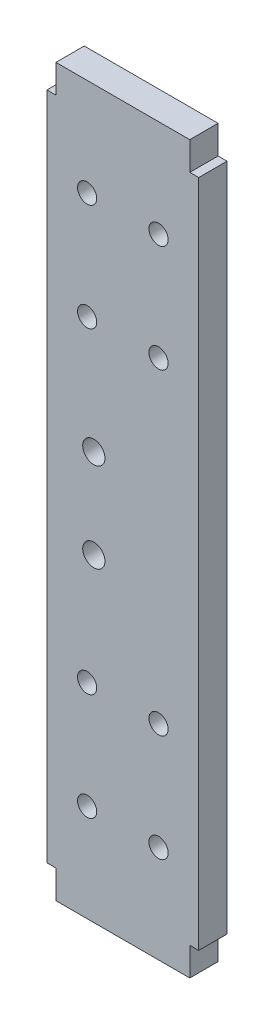
ISO-10303-21;
HEADER;
FILE_DESCRIPTION(('STEP AP214'),'2;1');
FILE_NAME('part.step','',(''),(''),'','','');
FILE_SCHEMA(('AUTOMOTIVE_DESIGN { 1 0 10303 214 1 1 1 1 }'));
ENDSEC;
DATA;
#1=APPLICATION_CONTEXT('core data for automotive mechanical design processes');
#2=APPLICATION_PROTOCOL_DEFINITION('international standard','automotive_design',2000,#1);
#3=PRODUCT_CONTEXT('',#1,'mechanical');
#4=PRODUCT('Part','Part','',(#3));
#5=PRODUCT_RELATED_PRODUCT_CATEGORY('part','',(#4));
#6=PRODUCT_DEFINITION_FORMATION('','',#4);
#7=PRODUCT_DEFINITION_CONTEXT('part definition',#1,'design');
#8=PRODUCT_DEFINITION('design','',#6,#7);
#9=PRODUCT_DEFINITION_SHAPE('','',#8);
#10=(LENGTH_UNIT() NAMED_UNIT(*) SI_UNIT(.MILLI.,.METRE.));
#11=(NAMED_UNIT(*) PLANE_ANGLE_UNIT() SI_UNIT($,.RADIAN.));
#12=(NAMED_UNIT(*) SI_UNIT($,.STERADIAN.) SOLID_ANGLE_UNIT());
#13=UNCERTAINTY_MEASURE_WITH_UNIT(LENGTH_MEASURE(1.E-05),#10,'distance_accuracy_value','');
#14=(GEOMETRIC_REPRESENTATION_CONTEXT(3) GLOBAL_UNCERTAINTY_ASSIGNED_CONTEXT((#13)) GLOBAL_UNIT_ASSIGNED_CONTEXT((#10,
#11,#12)) REPRESENTATION_CONTEXT('',''));
#15=CARTESIAN_POINT('',(0.,0.,0.));
#16=DIRECTION('',(0.,0.,1.));
#17=DIRECTION('',(1.,0.,0.));
#18=AXIS2_PLACEMENT_3D('',#15,#16,#17);
#19=CARTESIAN_POINT('',(-17.,-75.,6.35));
#20=DIRECTION('',(0.,1.,0.));
#21=DIRECTION('',(0.,0.,1.));
#22=AXIS2_PLACEMENT_3D('',#19,#20,#21);
#23=PLANE('',#22);
#24=DIRECTION('',(0.,0.,1.));
#25=VECTOR('',#24,1.);
#26=CARTESIAN_POINT('',(15.,-75.,0.));
#27=LINE('',#26,#25);
#28=CARTESIAN_POINT('',(15.,-75.,0.));
#29=VERTEX_POINT('',#28);
#30=CARTESIAN_POINT('',(15.,-75.,6.35));
#31=VERTEX_POINT('',#30);
#32=EDGE_CURVE('E133',#29,#31,#27,.T.);
#33=ORIENTED_EDGE('',*,*,#32,.F.);
#34=DIRECTION('',(1.,0.,0.));
#35=VECTOR('',#34,1.);
#36=CARTESIAN_POINT('',(-17.,-75.,0.));
#37=LINE('',#36,#35);
#38=CARTESIAN_POINT('',(17.,-75.,0.));
#39=VERTEX_POINT('',#38);
#40=EDGE_CURVE('E145',#29,#39,#37,.T.);
#41=ORIENTED_EDGE('',*,*,#40,.T.);
#42=DIRECTION('',(0.,0.,-1.));
#43=VECTOR('',#42,1.);
#44=CARTESIAN_POINT('',(17.,-75.,6.35));
#45=LINE('',#44,#43);
#46=CARTESIAN_POINT('',(17.,-75.,6.35));
#47=VERTEX_POINT('',#46);
#48=EDGE_CURVE('E11',#47,#39,#45,.T.);
#49=ORIENTED_EDGE('',*,*,#48,.F.);
#50=DIRECTION('',(1.,0.,0.));
#51=VECTOR('',#50,1.);
#52=CARTESIAN_POINT('',(-17.,-75.,6.35));
#53=LINE('',#52,#51);
#54=EDGE_CURVE('E323',#31,#47,#53,.T.);
#55=ORIENTED_EDGE('',*,*,#54,.F.);
#56=EDGE_LOOP('',(#33,#41,#49,#55));
#57=FACE_BOUND('',#56,.T.);
#58=ADVANCED_FACE('F32',(#57),#23,.F.);
#59=CARTESIAN_POINT('',(-17.,75.,6.35));
#60=DIRECTION('',(0.,-1.,0.));
#61=DIRECTION('',(0.,0.,-1.));
#62=AXIS2_PLACEMENT_3D('',#59,#60,#61);
#63=PLANE('',#62);
#64=DIRECTION('',(0.,0.,1.));
#65=VECTOR('',#64,1.);
#66=CARTESIAN_POINT('',(-15.,75.,0.));
#67=LINE('',#66,#65);
#68=CARTESIAN_POINT('',(-15.,75.,0.));
#69=VERTEX_POINT('',#68);
#70=CARTESIAN_POINT('',(-15.,75.,6.35));
#71=VERTEX_POINT('',#70);
#72=EDGE_CURVE('E336',#69,#71,#67,.T.);
#73=ORIENTED_EDGE('',*,*,#72,.F.);
#74=DIRECTION('',(-1.,0.,0.));
#75=VECTOR('',#74,1.);
#76=CARTESIAN_POINT('',(-17.,75.,0.));
#77=LINE('',#76,#75);
#78=CARTESIAN_POINT('',(-17.,75.,0.));
#79=VERTEX_POINT('',#78);
#80=EDGE_CURVE('E273',#69,#79,#77,.T.);
#81=ORIENTED_EDGE('',*,*,#80,.T.);
#82=DIRECTION('',(0.,0.,-1.));
#83=VECTOR('',#82,1.);
#84=CARTESIAN_POINT('',(-17.,75.,6.35));
#85=LINE('',#84,#83);
#86=CARTESIAN_POINT('',(-17.,75.,6.35));
#87=VERTEX_POINT('',#86);
#88=EDGE_CURVE('E301',#87,#79,#85,.T.);
#89=ORIENTED_EDGE('',*,*,#88,.F.);
#90=DIRECTION('',(-1.,0.,0.));
#91=VECTOR('',#90,1.);
#92=CARTESIAN_POINT('',(-17.,75.,6.35));
#93=LINE('',#92,#91);
#94=EDGE_CURVE('E307',#71,#87,#93,.T.);
#95=ORIENTED_EDGE('',*,*,#94,.F.);
#96=EDGE_LOOP('',(#73,#81,#89,#95));
#97=FACE_BOUND('',#96,.T.);
#98=ADVANCED_FACE('F248',(#97),#63,.F.);
#99=CARTESIAN_POINT('',(-17.,-75.,0.));
#100=VERTEX_POINT('',#99);
#101=CARTESIAN_POINT('',(-15.,-75.,0.));
#102=VERTEX_POINT('',#101);
#103=EDGE_CURVE('E265',#100,#102,#37,.T.);
#104=ORIENTED_EDGE('',*,*,#103,.T.);
#105=DIRECTION('',(0.,0.,1.));
#106=VECTOR('',#105,1.);
#107=CARTESIAN_POINT('',(-15.,-75.,0.));
#108=LINE('',#107,#106);
#109=CARTESIAN_POINT('',(-15.,-75.,6.35));
#110=VERTEX_POINT('',#109);
#111=EDGE_CURVE('E159',#102,#110,#108,.T.);
#112=ORIENTED_EDGE('',*,*,#111,.T.);
#113=CARTESIAN_POINT('',(-17.,-75.,6.35));
#114=VERTEX_POINT('',#113);
#115=EDGE_CURVE('E316',#114,#110,#53,.T.);
#116=ORIENTED_EDGE('',*,*,#115,.F.);
#117=DIRECTION('',(0.,0.,-1.));
#118=VECTOR('',#117,1.);
#119=CARTESIAN_POINT('',(-17.,-75.,6.35));
#120=LINE('',#119,#118);
#121=EDGE_CURVE('E269',#114,#100,#120,.T.);
#122=ORIENTED_EDGE('',*,*,#121,.T.);
#123=EDGE_LOOP('',(#104,#112,#116,#122));
#124=FACE_BOUND('',#123,.T.);
#125=ADVANCED_FACE('F34',(#124),#23,.F.);
#126=CARTESIAN_POINT('',(17.,-75.,6.35));
#127=DIRECTION('',(-1.,0.,0.));
#128=DIRECTION('',(0.,0.,1.));
#129=AXIS2_PLACEMENT_3D('',#126,#127,#128);
#130=PLANE('',#129);
#131=DIRECTION('',(0.,1.,0.));
#132=VECTOR('',#131,1.);
#133=CARTESIAN_POINT('',(17.,-75.,0.));
#134=LINE('',#133,#132);
#135=CARTESIAN_POINT('',(17.,75.,0.));
#136=VERTEX_POINT('',#135);
#137=EDGE_CURVE('E271',#39,#136,#134,.T.);
#138=ORIENTED_EDGE('',*,*,#137,.T.);
#139=DIRECTION('',(0.,0.,-1.));
#140=VECTOR('',#139,1.);
#141=CARTESIAN_POINT('',(17.,75.,6.35));
#142=LINE('',#141,#140);
#143=CARTESIAN_POINT('',(17.,75.,6.35));
#144=VERTEX_POINT('',#143);
#145=EDGE_CURVE('E41',#144,#136,#142,.T.);
#146=ORIENTED_EDGE('',*,*,#145,.F.);
#147=DIRECTION('',(0.,1.,0.));
#148=VECTOR('',#147,1.);
#149=CARTESIAN_POINT('',(17.,-75.,6.35));
#150=LINE('',#149,#148);
#151=EDGE_CURVE('E309',#47,#144,#150,.T.);
#152=ORIENTED_EDGE('',*,*,#151,.F.);
#153=ORIENTED_EDGE('',*,*,#48,.T.);
#154=EDGE_LOOP('',(#138,#146,#152,#153));
#155=FACE_BOUND('',#154,.T.);
#156=ADVANCED_FACE('F257',(#155),#130,.F.);
#157=CARTESIAN_POINT('',(15.,75.,0.));
#158=VERTEX_POINT('',#157);
#159=EDGE_CURVE('E296',#136,#158,#77,.T.);
#160=ORIENTED_EDGE('',*,*,#159,.T.);
#161=DIRECTION('',(0.,0.,1.));
#162=VECTOR('',#161,1.);
#163=CARTESIAN_POINT('',(15.,75.,0.));
#164=LINE('',#163,#162);
#165=CARTESIAN_POINT('',(15.,75.,6.35));
#166=VERTEX_POINT('',#165);
#167=EDGE_CURVE('E340',#158,#166,#164,.T.);
#168=ORIENTED_EDGE('',*,*,#167,.T.);
#169=EDGE_CURVE('E303',#144,#166,#93,.T.);
#170=ORIENTED_EDGE('',*,*,#169,.F.);
#171=ORIENTED_EDGE('',*,*,#145,.T.);
#172=EDGE_LOOP('',(#160,#168,#170,#171));
#173=FACE_BOUND('',#172,.T.);
#174=ADVANCED_FACE('F255',(#173),#63,.F.);
#175=CARTESIAN_POINT('',(-17.,-75.,6.35));
#176=DIRECTION('',(1.,0.,0.));
#177=DIRECTION('',(0.,0.,-1.));
#178=AXIS2_PLACEMENT_3D('',#175,#176,#177);
#179=PLANE('',#178);
#180=DIRECTION('',(0.,-1.,0.));
#181=VECTOR('',#180,1.);
#182=CARTESIAN_POINT('',(-17.,-75.,0.));
#183=LINE('',#182,#181);
#184=EDGE_CURVE('E290',#79,#100,#183,.T.);
#185=ORIENTED_EDGE('',*,*,#184,.T.);
#186=ORIENTED_EDGE('',*,*,#121,.F.);
#187=DIRECTION('',(0.,-1.,0.));
#188=VECTOR('',#187,1.);
#189=CARTESIAN_POINT('',(-17.,-75.,6.35));
#190=LINE('',#189,#188);
#191=EDGE_CURVE('E284',#87,#114,#190,.T.);
#192=ORIENTED_EDGE('',*,*,#191,.F.);
#193=ORIENTED_EDGE('',*,*,#88,.T.);
#194=EDGE_LOOP('',(#185,#186,#192,#193));
#195=FACE_BOUND('',#194,.T.);
#196=ADVANCED_FACE('F327',(#195),#179,.F.);
#197=CARTESIAN_POINT('',(0.,0.,6.35));
#198=DIRECTION('',(0.,0.,1.));
#199=DIRECTION('',(1.,0.,0.));
#200=AXIS2_PLACEMENT_3D('',#197,#198,#199);
#201=PLANE('',#200);
#202=CARTESIAN_POINT('',(-6.5,10.,6.35));
#203=DIRECTION('',(0.,0.,1.));
#204=DIRECTION('',(1.,0.,0.));
#205=AXIS2_PLACEMENT_3D('',#202,#203,#204);
#206=CIRCLE('',#205,2.48919999999999);
#207=CARTESIAN_POINT('',(-4.01080000000001,10.,6.35));
#208=VERTEX_POINT('',#207);
#209=EDGE_CURVE('E536',#208,#208,#206,.T.);
#210=ORIENTED_EDGE('',*,*,#209,.F.);
#211=EDGE_LOOP('',(#210));
#212=FACE_BOUND('',#211,.T.);
#213=CARTESIAN_POINT('',(-6.5,-10.,6.35));
#214=DIRECTION('',(0.,0.,1.));
#215=DIRECTION('',(1.,0.,0.));
#216=AXIS2_PLACEMENT_3D('',#213,#214,#215);
#217=CIRCLE('',#216,2.48919999999999);
#218=CARTESIAN_POINT('',(-4.01080000000001,-10.,6.35));
#219=VERTEX_POINT('',#218);
#220=EDGE_CURVE('E210',#219,#219,#217,.T.);
#221=ORIENTED_EDGE('',*,*,#220,.F.);
#222=EDGE_LOOP('',(#221));
#223=FACE_BOUND('',#222,.T.);
#224=CARTESIAN_POINT('',(-8.,59.5,6.35));
#225=DIRECTION('',(0.,0.,1.));
#226=DIRECTION('',(1.,0.,0.));
#227=AXIS2_PLACEMENT_3D('',#224,#225,#226);
#228=CIRCLE('',#227,2.15265);
#229=CARTESIAN_POINT('',(-5.84735,59.5,6.35));
#230=VERTEX_POINT('',#229);
#231=EDGE_CURVE('E199',#230,#230,#228,.T.);
#232=ORIENTED_EDGE('',*,*,#231,.F.);
#233=EDGE_LOOP('',(#232));
#234=FACE_BOUND('',#233,.T.);
#235=CARTESIAN_POINT('',(8.,59.5,6.35));
#236=DIRECTION('',(0.,0.,1.));
#237=DIRECTION('',(1.,0.,0.));
#238=AXIS2_PLACEMENT_3D('',#235,#236,#237);
#239=CIRCLE('',#238,2.15265);
#240=CARTESIAN_POINT('',(10.15265,59.5,6.35));
#241=VERTEX_POINT('',#240);
#242=EDGE_CURVE('E196',#241,#241,#239,.T.);
#243=ORIENTED_EDGE('',*,*,#242,.F.);
#244=EDGE_LOOP('',(#243));
#245=FACE_BOUND('',#244,.T.);
#246=CARTESIAN_POINT('',(8.,35.5,6.35));
#247=DIRECTION('',(0.,0.,1.));
#248=DIRECTION('',(1.,0.,0.));
#249=AXIS2_PLACEMENT_3D('',#246,#247,#248);
#250=CIRCLE('',#249,2.15265);
#251=CARTESIAN_POINT('',(10.15265,35.5,6.35));
#252=VERTEX_POINT('',#251);
#253=EDGE_CURVE('E193',#252,#252,#250,.T.);
#254=ORIENTED_EDGE('',*,*,#253,.F.);
#255=EDGE_LOOP('',(#254));
#256=FACE_BOUND('',#255,.T.);
#257=CARTESIAN_POINT('',(-8.,35.5,6.35));
#258=DIRECTION('',(0.,0.,1.));
#259=DIRECTION('',(1.,0.,0.));
#260=AXIS2_PLACEMENT_3D('',#257,#258,#259);
#261=CIRCLE('',#260,2.15265);
#262=CARTESIAN_POINT('',(-5.84735,35.5,6.35));
#263=VERTEX_POINT('',#262);
#264=EDGE_CURVE('E189',#263,#263,#261,.T.);
#265=ORIENTED_EDGE('',*,*,#264,.F.);
#266=EDGE_LOOP('',(#265));
#267=FACE_BOUND('',#266,.T.);
#268=CARTESIAN_POINT('',(-7.99999999999999,-35.5,6.35));
#269=DIRECTION('',(0.,0.,1.));
#270=DIRECTION('',(1.,0.,0.));
#271=AXIS2_PLACEMENT_3D('',#268,#269,#270);
#272=CIRCLE('',#271,2.15265);
#273=CARTESIAN_POINT('',(-5.84734999999999,-35.5,6.35));
#274=VERTEX_POINT('',#273);
#275=EDGE_CURVE('E188',#274,#274,#272,.T.);
#276=ORIENTED_EDGE('',*,*,#275,.F.);
#277=EDGE_LOOP('',(#276));
#278=FACE_BOUND('',#277,.T.);
#279=CARTESIAN_POINT('',(-8.,-59.5,6.35));
#280=DIRECTION('',(0.,0.,1.));
#281=DIRECTION('',(1.,0.,0.));
#282=AXIS2_PLACEMENT_3D('',#279,#280,#281);
#283=CIRCLE('',#282,2.15265);
#284=CARTESIAN_POINT('',(-5.84735,-59.5,6.35));
#285=VERTEX_POINT('',#284);
#286=EDGE_CURVE('E184',#285,#285,#283,.T.);
#287=ORIENTED_EDGE('',*,*,#286,.F.);
#288=EDGE_LOOP('',(#287));
#289=FACE_BOUND('',#288,.T.);
#290=CARTESIAN_POINT('',(8.,-59.5,6.35));
#291=DIRECTION('',(0.,0.,1.));
#292=DIRECTION('',(1.,0.,0.));
#293=AXIS2_PLACEMENT_3D('',#290,#291,#292);
#294=CIRCLE('',#293,2.15265);
#295=CARTESIAN_POINT('',(10.15265,-59.5,6.35));
#296=VERTEX_POINT('',#295);
#297=EDGE_CURVE('E180',#296,#296,#294,.T.);
#298=ORIENTED_EDGE('',*,*,#297,.F.);
#299=EDGE_LOOP('',(#298));
#300=FACE_BOUND('',#299,.T.);
#301=CARTESIAN_POINT('',(8.00000000000001,-35.5,6.35));
#302=DIRECTION('',(0.,0.,1.));
#303=DIRECTION('',(1.,0.,0.));
#304=AXIS2_PLACEMENT_3D('',#301,#302,#303);
#305=CIRCLE('',#304,2.15265);
#306=CARTESIAN_POINT('',(10.15265,-35.5,6.35));
#307=VERTEX_POINT('',#306);
#308=EDGE_CURVE('E179',#307,#307,#305,.T.);
#309=ORIENTED_EDGE('',*,*,#308,.F.);
#310=EDGE_LOOP('',(#309));
#311=FACE_BOUND('',#310,.T.);
#312=ORIENTED_EDGE('',*,*,#115,.T.);
#313=DIRECTION('',(0.,-1.,0.));
#314=VECTOR('',#313,1.);
#315=CARTESIAN_POINT('',(-15.,-81.35,6.35));
#316=LINE('',#315,#314);
#317=CARTESIAN_POINT('',(-15.,-81.35,6.35));
#318=VERTEX_POINT('',#317);
#319=EDGE_CURVE('E49',#110,#318,#316,.T.);
#320=ORIENTED_EDGE('',*,*,#319,.T.);
#321=DIRECTION('',(1.,0.,0.));
#322=VECTOR('',#321,1.);
#323=CARTESIAN_POINT('',(-15.,-81.35,6.35));
#324=LINE('',#323,#322);
#325=CARTESIAN_POINT('',(15.,-81.35,6.35));
#326=VERTEX_POINT('',#325);
#327=EDGE_CURVE('E155',#318,#326,#324,.T.);
#328=ORIENTED_EDGE('',*,*,#327,.T.);
#329=DIRECTION('',(0.,1.,0.));
#330=VECTOR('',#329,1.);
#331=CARTESIAN_POINT('',(15.,-81.35,6.35));
#332=LINE('',#331,#330);
#333=EDGE_CURVE('E128',#326,#31,#332,.T.);
#334=ORIENTED_EDGE('',*,*,#333,.T.);
#335=ORIENTED_EDGE('',*,*,#54,.T.);
#336=ORIENTED_EDGE('',*,*,#151,.T.);
#337=ORIENTED_EDGE('',*,*,#169,.T.);
#338=DIRECTION('',(0.,1.,0.));
#339=VECTOR('',#338,1.);
#340=CARTESIAN_POINT('',(15.,81.35,6.35));
#341=LINE('',#340,#339);
#342=CARTESIAN_POINT('',(15.,81.35,6.35));
#343=VERTEX_POINT('',#342);
#344=EDGE_CURVE('E57',#166,#343,#341,.T.);
#345=ORIENTED_EDGE('',*,*,#344,.T.);
#346=DIRECTION('',(-1.,0.,0.));
#347=VECTOR('',#346,1.);
#348=CARTESIAN_POINT('',(-15.,81.35,6.35));
#349=LINE('',#348,#347);
#350=CARTESIAN_POINT('',(-15.,81.35,6.35));
#351=VERTEX_POINT('',#350);
#352=EDGE_CURVE('E158',#343,#351,#349,.T.);
#353=ORIENTED_EDGE('',*,*,#352,.T.);
#354=DIRECTION('',(0.,-1.,0.));
#355=VECTOR('',#354,1.);
#356=CARTESIAN_POINT('',(-15.,81.35,6.35));
#357=LINE('',#356,#355);
#358=EDGE_CURVE('E361',#351,#71,#357,.T.);
#359=ORIENTED_EDGE('',*,*,#358,.T.);
#360=ORIENTED_EDGE('',*,*,#94,.T.);
#361=ORIENTED_EDGE('',*,*,#191,.T.);
#362=EDGE_LOOP('',(#312,#320,#328,#334,#335,#336,#337,#345,#353,#359,#360,#361));
#363=FACE_BOUND('',#362,.T.);
#364=ADVANCED_FACE('F365',(#212,#223,#234,#245,#256,#267,#278,#289,#300,#311,#363),#201,.T.);
#365=CARTESIAN_POINT('',(0.,0.,0.));
#366=DIRECTION('',(0.,0.,1.));
#367=DIRECTION('',(1.,0.,0.));
#368=AXIS2_PLACEMENT_3D('',#365,#366,#367);
#369=PLANE('',#368);
#370=CARTESIAN_POINT('',(-6.5,10.,0.));
#371=DIRECTION('',(0.,0.,1.));
#372=DIRECTION('',(1.,0.,0.));
#373=AXIS2_PLACEMENT_3D('',#370,#371,#372);
#374=CIRCLE('',#373,2.48919999999999);
#375=CARTESIAN_POINT('',(-4.0108,10.,0.));
#376=VERTEX_POINT('',#375);
#377=EDGE_CURVE('E36',#376,#376,#374,.T.);
#378=ORIENTED_EDGE('',*,*,#377,.T.);
#379=EDGE_LOOP('',(#378));
#380=FACE_BOUND('',#379,.T.);
#381=CARTESIAN_POINT('',(-6.5,-10.,0.));
#382=DIRECTION('',(0.,0.,1.));
#383=DIRECTION('',(1.,0.,0.));
#384=AXIS2_PLACEMENT_3D('',#381,#382,#383);
#385=CIRCLE('',#384,2.48919999999999);
#386=CARTESIAN_POINT('',(-4.0108,-10.,0.));
#387=VERTEX_POINT('',#386);
#388=EDGE_CURVE('E205',#387,#387,#385,.T.);
#389=ORIENTED_EDGE('',*,*,#388,.T.);
#390=EDGE_LOOP('',(#389));
#391=FACE_BOUND('',#390,.T.);
#392=CARTESIAN_POINT('',(-8.,59.5,0.));
#393=DIRECTION('',(0.,0.,1.));
#394=DIRECTION('',(1.,0.,0.));
#395=AXIS2_PLACEMENT_3D('',#392,#393,#394);
#396=CIRCLE('',#395,2.15265);
#397=CARTESIAN_POINT('',(-5.84735,59.5,0.));
#398=VERTEX_POINT('',#397);
#399=EDGE_CURVE('E197',#398,#398,#396,.T.);
#400=ORIENTED_EDGE('',*,*,#399,.T.);
#401=EDGE_LOOP('',(#400));
#402=FACE_BOUND('',#401,.T.);
#403=CARTESIAN_POINT('',(8.,59.5,0.));
#404=DIRECTION('',(0.,0.,1.));
#405=DIRECTION('',(1.,0.,0.));
#406=AXIS2_PLACEMENT_3D('',#403,#404,#405);
#407=CIRCLE('',#406,2.15265);
#408=CARTESIAN_POINT('',(10.15265,59.5,0.));
#409=VERTEX_POINT('',#408);
#410=EDGE_CURVE('E194',#409,#409,#407,.T.);
#411=ORIENTED_EDGE('',*,*,#410,.T.);
#412=EDGE_LOOP('',(#411));
#413=FACE_BOUND('',#412,.T.);
#414=CARTESIAN_POINT('',(8.,35.5,0.));
#415=DIRECTION('',(0.,0.,1.));
#416=DIRECTION('',(1.,0.,0.));
#417=AXIS2_PLACEMENT_3D('',#414,#415,#416);
#418=CIRCLE('',#417,2.15265);
#419=CARTESIAN_POINT('',(10.15265,35.5,0.));
#420=VERTEX_POINT('',#419);
#421=EDGE_CURVE('E190',#420,#420,#418,.T.);
#422=ORIENTED_EDGE('',*,*,#421,.T.);
#423=EDGE_LOOP('',(#422));
#424=FACE_BOUND('',#423,.T.);
#425=CARTESIAN_POINT('',(-8.,35.5,0.));
#426=DIRECTION('',(0.,0.,1.));
#427=DIRECTION('',(1.,0.,0.));
#428=AXIS2_PLACEMENT_3D('',#425,#426,#427);
#429=CIRCLE('',#428,2.15265);
#430=CARTESIAN_POINT('',(-5.84735,35.5,0.));
#431=VERTEX_POINT('',#430);
#432=EDGE_CURVE('E185',#431,#431,#429,.T.);
#433=ORIENTED_EDGE('',*,*,#432,.T.);
#434=EDGE_LOOP('',(#433));
#435=FACE_BOUND('',#434,.T.);
#436=CARTESIAN_POINT('',(-7.99999999999999,-35.5,0.));
#437=DIRECTION('',(0.,0.,1.));
#438=DIRECTION('',(1.,0.,0.));
#439=AXIS2_PLACEMENT_3D('',#436,#437,#438);
#440=CIRCLE('',#439,2.15265);
#441=CARTESIAN_POINT('',(-5.84734999999999,-35.5,0.));
#442=VERTEX_POINT('',#441);
#443=EDGE_CURVE('E220',#442,#442,#440,.T.);
#444=ORIENTED_EDGE('',*,*,#443,.T.);
#445=EDGE_LOOP('',(#444));
#446=FACE_BOUND('',#445,.T.);
#447=CARTESIAN_POINT('',(-8.,-59.5,0.));
#448=DIRECTION('',(0.,0.,1.));
#449=DIRECTION('',(1.,0.,0.));
#450=AXIS2_PLACEMENT_3D('',#447,#448,#449);
#451=CIRCLE('',#450,2.15265);
#452=CARTESIAN_POINT('',(-5.84735,-59.5,0.));
#453=VERTEX_POINT('',#452);
#454=EDGE_CURVE('E181',#453,#453,#451,.T.);
#455=ORIENTED_EDGE('',*,*,#454,.T.);
#456=EDGE_LOOP('',(#455));
#457=FACE_BOUND('',#456,.T.);
#458=CARTESIAN_POINT('',(8.,-59.5,0.));
#459=DIRECTION('',(0.,0.,1.));
#460=DIRECTION('',(1.,0.,0.));
#461=AXIS2_PLACEMENT_3D('',#458,#459,#460);
#462=CIRCLE('',#461,2.15265);
#463=CARTESIAN_POINT('',(10.15265,-59.5,0.));
#464=VERTEX_POINT('',#463);
#465=EDGE_CURVE('E176',#464,#464,#462,.T.);
#466=ORIENTED_EDGE('',*,*,#465,.T.);
#467=EDGE_LOOP('',(#466));
#468=FACE_BOUND('',#467,.T.);
#469=CARTESIAN_POINT('',(8.00000000000001,-35.5,0.));
#470=DIRECTION('',(0.,0.,1.));
#471=DIRECTION('',(1.,0.,0.));
#472=AXIS2_PLACEMENT_3D('',#469,#470,#471);
#473=CIRCLE('',#472,2.15265);
#474=CARTESIAN_POINT('',(10.15265,-35.5,0.));
#475=VERTEX_POINT('',#474);
#476=EDGE_CURVE('E153',#475,#475,#473,.T.);
#477=ORIENTED_EDGE('',*,*,#476,.T.);
#478=EDGE_LOOP('',(#477));
#479=FACE_BOUND('',#478,.T.);
#480=ORIENTED_EDGE('',*,*,#103,.F.);
#481=ORIENTED_EDGE('',*,*,#184,.F.);
#482=ORIENTED_EDGE('',*,*,#80,.F.);
#483=DIRECTION('',(0.,-1.,0.));
#484=VECTOR('',#483,1.);
#485=CARTESIAN_POINT('',(-15.,81.35,0.));
#486=LINE('',#485,#484);
#487=CARTESIAN_POINT('',(-15.,81.35,0.));
#488=VERTEX_POINT('',#487);
#489=EDGE_CURVE('E332',#488,#69,#486,.T.);
#490=ORIENTED_EDGE('',*,*,#489,.F.);
#491=DIRECTION('',(-1.,0.,0.));
#492=VECTOR('',#491,1.);
#493=CARTESIAN_POINT('',(-15.,81.35,0.));
#494=LINE('',#493,#492);
#495=CARTESIAN_POINT('',(15.,81.35,0.));
#496=VERTEX_POINT('',#495);
#497=EDGE_CURVE('E358',#496,#488,#494,.T.);
#498=ORIENTED_EDGE('',*,*,#497,.F.);
#499=DIRECTION('',(0.,1.,0.));
#500=VECTOR('',#499,1.);
#501=CARTESIAN_POINT('',(15.,81.35,0.));
#502=LINE('',#501,#500);
#503=EDGE_CURVE('E343',#158,#496,#502,.T.);
#504=ORIENTED_EDGE('',*,*,#503,.F.);
#505=ORIENTED_EDGE('',*,*,#159,.F.);
#506=ORIENTED_EDGE('',*,*,#137,.F.);
#507=ORIENTED_EDGE('',*,*,#40,.F.);
#508=DIRECTION('',(0.,1.,0.));
#509=VECTOR('',#508,1.);
#510=CARTESIAN_POINT('',(15.,-81.35,0.));
#511=LINE('',#510,#509);
#512=CARTESIAN_POINT('',(15.,-81.35,0.));
#513=VERTEX_POINT('',#512);
#514=EDGE_CURVE('E125',#513,#29,#511,.T.);
#515=ORIENTED_EDGE('',*,*,#514,.F.);
#516=DIRECTION('',(1.,0.,0.));
#517=VECTOR('',#516,1.);
#518=CARTESIAN_POINT('',(-15.,-81.35,0.));
#519=LINE('',#518,#517);
#520=CARTESIAN_POINT('',(-15.,-81.35,0.));
#521=VERTEX_POINT('',#520);
#522=EDGE_CURVE('E142',#521,#513,#519,.T.);
#523=ORIENTED_EDGE('',*,*,#522,.F.);
#524=DIRECTION('',(0.,-1.,0.));
#525=VECTOR('',#524,1.);
#526=CARTESIAN_POINT('',(-15.,-81.35,0.));
#527=LINE('',#526,#525);
#528=EDGE_CURVE('E134',#102,#521,#527,.T.);
#529=ORIENTED_EDGE('',*,*,#528,.F.);
#530=EDGE_LOOP('',(#480,#481,#482,#490,#498,#504,#505,#506,#507,#515,#523,#529));
#531=FACE_BOUND('',#530,.T.);
#532=ADVANCED_FACE('F140',(#380,#391,#402,#413,#424,#435,#446,#457,#468,#479,#531),#369,.F.);
#533=CARTESIAN_POINT('',(-15.,81.35,0.));
#534=DIRECTION('',(0.,1.,0.));
#535=DIRECTION('',(0.,0.,1.));
#536=AXIS2_PLACEMENT_3D('',#533,#534,#535);
#537=PLANE('',#536);
#538=ORIENTED_EDGE('',*,*,#352,.F.);
#539=DIRECTION('',(0.,0.,1.));
#540=VECTOR('',#539,1.);
#541=CARTESIAN_POINT('',(15.,81.35,0.));
#542=LINE('',#541,#540);
#543=EDGE_CURVE('E275',#496,#343,#542,.T.);
#544=ORIENTED_EDGE('',*,*,#543,.F.);
#545=ORIENTED_EDGE('',*,*,#497,.T.);
#546=DIRECTION('',(0.,0.,1.));
#547=VECTOR('',#546,1.);
#548=CARTESIAN_POINT('',(-15.,81.35,0.));
#549=LINE('',#548,#547);
#550=EDGE_CURVE('E319',#488,#351,#549,.T.);
#551=ORIENTED_EDGE('',*,*,#550,.T.);
#552=EDGE_LOOP('',(#538,#544,#545,#551));
#553=FACE_BOUND('',#552,.T.);
#554=ADVANCED_FACE('F367',(#553),#537,.T.);
#555=CARTESIAN_POINT('',(15.,81.35,0.));
#556=DIRECTION('',(1.,0.,0.));
#557=DIRECTION('',(0.,0.,-1.));
#558=AXIS2_PLACEMENT_3D('',#555,#556,#557);
#559=PLANE('',#558);
#560=ORIENTED_EDGE('',*,*,#344,.F.);
#561=ORIENTED_EDGE('',*,*,#167,.F.);
#562=ORIENTED_EDGE('',*,*,#503,.T.);
#563=ORIENTED_EDGE('',*,*,#543,.T.);
#564=EDGE_LOOP('',(#560,#561,#562,#563));
#565=FACE_BOUND('',#564,.T.);
#566=ADVANCED_FACE('F372',(#565),#559,.T.);
#567=CARTESIAN_POINT('',(-15.,81.35,0.));
#568=DIRECTION('',(-1.,0.,0.));
#569=DIRECTION('',(0.,0.,1.));
#570=AXIS2_PLACEMENT_3D('',#567,#568,#569);
#571=PLANE('',#570);
#572=ORIENTED_EDGE('',*,*,#358,.F.);
#573=ORIENTED_EDGE('',*,*,#550,.F.);
#574=ORIENTED_EDGE('',*,*,#489,.T.);
#575=ORIENTED_EDGE('',*,*,#72,.T.);
#576=EDGE_LOOP('',(#572,#573,#574,#575));
#577=FACE_BOUND('',#576,.T.);
#578=ADVANCED_FACE('F366',(#577),#571,.T.);
#579=CARTESIAN_POINT('',(-15.,-81.35,0.));
#580=DIRECTION('',(0.,-1.,0.));
#581=DIRECTION('',(0.,0.,-1.));
#582=AXIS2_PLACEMENT_3D('',#579,#580,#581);
#583=PLANE('',#582);
#584=ORIENTED_EDGE('',*,*,#327,.F.);
#585=DIRECTION('',(0.,0.,1.));
#586=VECTOR('',#585,1.);
#587=CARTESIAN_POINT('',(-15.,-81.35,0.));
#588=LINE('',#587,#586);
#589=EDGE_CURVE('E148',#521,#318,#588,.T.);
#590=ORIENTED_EDGE('',*,*,#589,.F.);
#591=ORIENTED_EDGE('',*,*,#522,.T.);
#592=DIRECTION('',(0.,0.,1.));
#593=VECTOR('',#592,1.);
#594=CARTESIAN_POINT('',(15.,-81.35,0.));
#595=LINE('',#594,#593);
#596=EDGE_CURVE('E122',#513,#326,#595,.T.);
#597=ORIENTED_EDGE('',*,*,#596,.T.);
#598=EDGE_LOOP('',(#584,#590,#591,#597));
#599=FACE_BOUND('',#598,.T.);
#600=ADVANCED_FACE('F147',(#599),#583,.T.);
#601=CARTESIAN_POINT('',(-15.,-81.35,0.));
#602=DIRECTION('',(-1.,0.,0.));
#603=DIRECTION('',(0.,0.,1.));
#604=AXIS2_PLACEMENT_3D('',#601,#602,#603);
#605=PLANE('',#604);
#606=ORIENTED_EDGE('',*,*,#319,.F.);
#607=ORIENTED_EDGE('',*,*,#111,.F.);
#608=ORIENTED_EDGE('',*,*,#528,.T.);
#609=ORIENTED_EDGE('',*,*,#589,.T.);
#610=EDGE_LOOP('',(#606,#607,#608,#609));
#611=FACE_BOUND('',#610,.T.);
#612=ADVANCED_FACE('F244',(#611),#605,.T.);
#613=CARTESIAN_POINT('',(15.,-81.35,0.));
#614=DIRECTION('',(1.,0.,0.));
#615=DIRECTION('',(0.,0.,-1.));
#616=AXIS2_PLACEMENT_3D('',#613,#614,#615);
#617=PLANE('',#616);
#618=ORIENTED_EDGE('',*,*,#333,.F.);
#619=ORIENTED_EDGE('',*,*,#596,.F.);
#620=ORIENTED_EDGE('',*,*,#514,.T.);
#621=ORIENTED_EDGE('',*,*,#32,.T.);
#622=EDGE_LOOP('',(#618,#619,#620,#621));
#623=FACE_BOUND('',#622,.T.);
#624=ADVANCED_FACE('F124',(#623),#617,.T.);
#625=CARTESIAN_POINT('',(8.00000000000001,-35.5,6.35));
#626=DIRECTION('',(0.,0.,1.));
#627=DIRECTION('',(1.,0.,0.));
#628=AXIS2_PLACEMENT_3D('',#625,#626,#627);
#629=CYLINDRICAL_SURFACE('',#628,2.15265);
#630=ORIENTED_EDGE('',*,*,#308,.T.);
#631=EDGE_LOOP('',(#630));
#632=FACE_BOUND('',#631,.T.);
#633=ORIENTED_EDGE('',*,*,#476,.F.);
#634=EDGE_LOOP('',(#633));
#635=FACE_BOUND('',#634,.T.);
#636=ADVANCED_FACE('F233',(#632,#635),#629,.F.);
#637=CARTESIAN_POINT('',(8.,-59.5,6.35));
#638=DIRECTION('',(0.,0.,1.));
#639=DIRECTION('',(1.,0.,0.));
#640=AXIS2_PLACEMENT_3D('',#637,#638,#639);
#641=CYLINDRICAL_SURFACE('',#640,2.15265);
#642=ORIENTED_EDGE('',*,*,#297,.T.);
#643=EDGE_LOOP('',(#642));
#644=FACE_BOUND('',#643,.T.);
#645=ORIENTED_EDGE('',*,*,#465,.F.);
#646=EDGE_LOOP('',(#645));
#647=FACE_BOUND('',#646,.T.);
#648=ADVANCED_FACE('F235',(#644,#647),#641,.F.);
#649=CARTESIAN_POINT('',(-8.,-59.5,6.35));
#650=DIRECTION('',(0.,0.,1.));
#651=DIRECTION('',(1.,0.,0.));
#652=AXIS2_PLACEMENT_3D('',#649,#650,#651);
#653=CYLINDRICAL_SURFACE('',#652,2.15265);
#654=ORIENTED_EDGE('',*,*,#286,.T.);
#655=EDGE_LOOP('',(#654));
#656=FACE_BOUND('',#655,.T.);
#657=ORIENTED_EDGE('',*,*,#454,.F.);
#658=EDGE_LOOP('',(#657));
#659=FACE_BOUND('',#658,.T.);
#660=ADVANCED_FACE('F241',(#656,#659),#653,.F.);
#661=CARTESIAN_POINT('',(-7.99999999999999,-35.5,6.35));
#662=DIRECTION('',(0.,0.,1.));
#663=DIRECTION('',(1.,0.,0.));
#664=AXIS2_PLACEMENT_3D('',#661,#662,#663);
#665=CYLINDRICAL_SURFACE('',#664,2.15265);
#666=ORIENTED_EDGE('',*,*,#275,.T.);
#667=EDGE_LOOP('',(#666));
#668=FACE_BOUND('',#667,.T.);
#669=ORIENTED_EDGE('',*,*,#443,.F.);
#670=EDGE_LOOP('',(#669));
#671=FACE_BOUND('',#670,.T.);
#672=ADVANCED_FACE('F462',(#668,#671),#665,.F.);
#673=CARTESIAN_POINT('',(-8.,35.5,6.35));
#674=DIRECTION('',(0.,0.,1.));
#675=DIRECTION('',(1.,0.,0.));
#676=AXIS2_PLACEMENT_3D('',#673,#674,#675);
#677=CYLINDRICAL_SURFACE('',#676,2.15265);
#678=ORIENTED_EDGE('',*,*,#264,.T.);
#679=EDGE_LOOP('',(#678));
#680=FACE_BOUND('',#679,.T.);
#681=ORIENTED_EDGE('',*,*,#432,.F.);
#682=EDGE_LOOP('',(#681));
#683=FACE_BOUND('',#682,.T.);
#684=ADVANCED_FACE('F472',(#680,#683),#677,.F.);
#685=CARTESIAN_POINT('',(8.,35.5,6.35));
#686=DIRECTION('',(0.,0.,1.));
#687=DIRECTION('',(1.,0.,0.));
#688=AXIS2_PLACEMENT_3D('',#685,#686,#687);
#689=CYLINDRICAL_SURFACE('',#688,2.15265);
#690=ORIENTED_EDGE('',*,*,#253,.T.);
#691=EDGE_LOOP('',(#690));
#692=FACE_BOUND('',#691,.T.);
#693=ORIENTED_EDGE('',*,*,#421,.F.);
#694=EDGE_LOOP('',(#693));
#695=FACE_BOUND('',#694,.T.);
#696=ADVANCED_FACE('F482',(#692,#695),#689,.F.);
#697=CARTESIAN_POINT('',(8.,59.5,6.35));
#698=DIRECTION('',(0.,0.,1.));
#699=DIRECTION('',(1.,0.,0.));
#700=AXIS2_PLACEMENT_3D('',#697,#698,#699);
#701=CYLINDRICAL_SURFACE('',#700,2.15265);
#702=ORIENTED_EDGE('',*,*,#242,.T.);
#703=EDGE_LOOP('',(#702));
#704=FACE_BOUND('',#703,.T.);
#705=ORIENTED_EDGE('',*,*,#410,.F.);
#706=EDGE_LOOP('',(#705));
#707=FACE_BOUND('',#706,.T.);
#708=ADVANCED_FACE('F492',(#704,#707),#701,.F.);
#709=CARTESIAN_POINT('',(-8.,59.5,6.35));
#710=DIRECTION('',(0.,0.,1.));
#711=DIRECTION('',(1.,0.,0.));
#712=AXIS2_PLACEMENT_3D('',#709,#710,#711);
#713=CYLINDRICAL_SURFACE('',#712,2.15265);
#714=ORIENTED_EDGE('',*,*,#231,.T.);
#715=EDGE_LOOP('',(#714));
#716=FACE_BOUND('',#715,.T.);
#717=ORIENTED_EDGE('',*,*,#399,.F.);
#718=EDGE_LOOP('',(#717));
#719=FACE_BOUND('',#718,.T.);
#720=ADVANCED_FACE('F501',(#716,#719),#713,.F.);
#721=CARTESIAN_POINT('',(-6.5,-10.,6.35));
#722=DIRECTION('',(0.,0.,1.));
#723=DIRECTION('',(1.,0.,0.));
#724=AXIS2_PLACEMENT_3D('',#721,#722,#723);
#725=CYLINDRICAL_SURFACE('',#724,2.48919999999999);
#726=ORIENTED_EDGE('',*,*,#220,.T.);
#727=EDGE_LOOP('',(#726));
#728=FACE_BOUND('',#727,.T.);
#729=ORIENTED_EDGE('',*,*,#388,.F.);
#730=EDGE_LOOP('',(#729));
#731=FACE_BOUND('',#730,.T.);
#732=ADVANCED_FACE('F510',(#728,#731),#725,.F.);
#733=CARTESIAN_POINT('',(-6.5,10.,6.35));
#734=DIRECTION('',(0.,0.,1.));
#735=DIRECTION('',(1.,0.,0.));
#736=AXIS2_PLACEMENT_3D('',#733,#734,#735);
#737=CYLINDRICAL_SURFACE('',#736,2.48919999999999);
#738=ORIENTED_EDGE('',*,*,#209,.T.);
#739=EDGE_LOOP('',(#738));
#740=FACE_BOUND('',#739,.T.);
#741=ORIENTED_EDGE('',*,*,#377,.F.);
#742=EDGE_LOOP('',(#741));
#743=FACE_BOUND('',#742,.T.);
#744=ADVANCED_FACE('F519',(#740,#743),#737,.F.);
#745=CLOSED_SHELL('',(#58,#98,#125,#156,#174,#196,#364,#532,#554,#566,#578,#600,#612,#624,#636,
#648,#660,#672,#684,#696,#708,#720,#732,#744));
#746=MANIFOLD_SOLID_BREP('B2',#745);
#747=ADVANCED_BREP_SHAPE_REPRESENTATION('',(#18,#746),#14);
#748=SHAPE_DEFINITION_REPRESENTATION(#9,#747);
ENDSEC;
END-ISO-10303-21;
